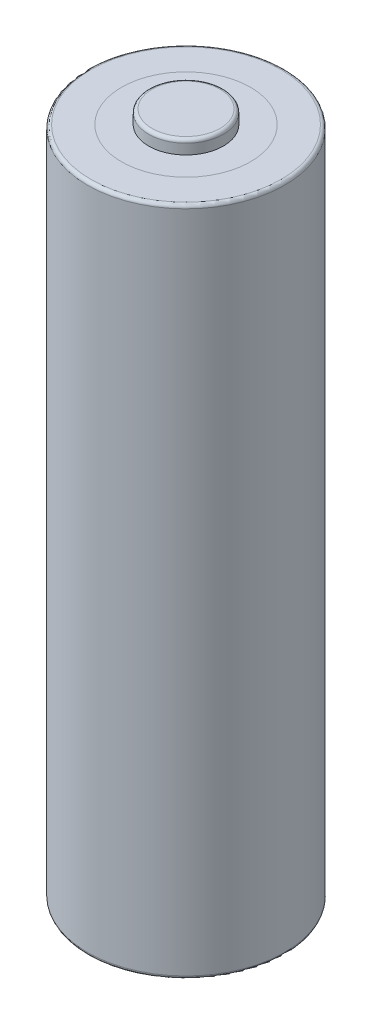
ISO-10303-21;
HEADER;
FILE_DESCRIPTION(('STEP AP214'),'2;1');
FILE_NAME('part.step','',(''),(''),'','','');
FILE_SCHEMA(('AUTOMOTIVE_DESIGN { 1 0 10303 214 1 1 1 1 }'));
ENDSEC;
DATA;
#1=APPLICATION_CONTEXT('core data for automotive mechanical design processes');
#2=APPLICATION_PROTOCOL_DEFINITION('international standard','automotive_design',2000,#1);
#3=PRODUCT_CONTEXT('',#1,'mechanical');
#4=PRODUCT('Part','Part','',(#3));
#5=PRODUCT_RELATED_PRODUCT_CATEGORY('part','',(#4));
#6=PRODUCT_DEFINITION_FORMATION('','',#4);
#7=PRODUCT_DEFINITION_CONTEXT('part definition',#1,'design');
#8=PRODUCT_DEFINITION('design','',#6,#7);
#9=PRODUCT_DEFINITION_SHAPE('','',#8);
#10=(LENGTH_UNIT() NAMED_UNIT(*) SI_UNIT(.MILLI.,.METRE.));
#11=(NAMED_UNIT(*) PLANE_ANGLE_UNIT() SI_UNIT($,.RADIAN.));
#12=(NAMED_UNIT(*) SI_UNIT($,.STERADIAN.) SOLID_ANGLE_UNIT());
#13=UNCERTAINTY_MEASURE_WITH_UNIT(LENGTH_MEASURE(1.E-05),#10,'distance_accuracy_value','');
#14=(GEOMETRIC_REPRESENTATION_CONTEXT(3) GLOBAL_UNCERTAINTY_ASSIGNED_CONTEXT((#13)) GLOBAL_UNIT_ASSIGNED_CONTEXT((#10,
#11,#12)) REPRESENTATION_CONTEXT('',''));
#15=CARTESIAN_POINT('',(0.,0.,0.));
#16=DIRECTION('',(0.,0.,1.));
#17=DIRECTION('',(1.,0.,0.));
#18=AXIS2_PLACEMENT_3D('',#15,#16,#17);
#19=CARTESIAN_POINT('',(0.,0.1,-7.));
#20=DIRECTION('',(0.,1.,0.));
#21=DIRECTION('',(0.,0.,1.));
#22=AXIS2_PLACEMENT_3D('',#19,#20,#21);
#23=PLANE('',#22);
#24=CARTESIAN_POINT('',(0.,0.1,0.));
#25=DIRECTION('',(0.,1.,0.));
#26=DIRECTION('',(0.,0.,1.));
#27=AXIS2_PLACEMENT_3D('',#24,#25,#26);
#28=CIRCLE('',#27,7.);
#29=CARTESIAN_POINT('',(0.,0.1,7.));
#30=VERTEX_POINT('',#29);
#31=EDGE_CURVE('E74',#30,#30,#28,.T.);
#32=ORIENTED_EDGE('',*,*,#31,.F.);
#33=EDGE_LOOP('',(#32));
#34=FACE_BOUND('',#33,.T.);
#35=CARTESIAN_POINT('',(0.,0.100000000000003,0.));
#36=DIRECTION('',(0.,1.,0.));
#37=DIRECTION('',(0.,0.,1.));
#38=AXIS2_PLACEMENT_3D('',#35,#36,#37);
#39=CIRCLE('',#38,4.74999999999999);
#40=CARTESIAN_POINT('',(0.,0.100000000000003,4.74999999999999));
#41=VERTEX_POINT('',#40);
#42=EDGE_CURVE('E10',#41,#41,#39,.F.);
#43=ORIENTED_EDGE('',*,*,#42,.F.);
#44=EDGE_LOOP('',(#43));
#45=FACE_BOUND('',#44,.T.);
#46=ADVANCED_FACE('F40',(#34,#45),#23,.F.);
#47=CARTESIAN_POINT('',(0.,49.5,-2.74999999999999));
#48=DIRECTION('',(0.,-1.,0.));
#49=DIRECTION('',(0.,0.,-1.));
#50=AXIS2_PLACEMENT_3D('',#47,#48,#49);
#51=PLANE('',#50);
#52=CARTESIAN_POINT('',(0.,49.5,0.));
#53=DIRECTION('',(0.,1.,0.));
#54=DIRECTION('',(0.,0.,1.));
#55=AXIS2_PLACEMENT_3D('',#52,#53,#54);
#56=CIRCLE('',#55,6.99999999999999);
#57=CARTESIAN_POINT('',(0.,49.5,6.99999999999999));
#58=VERTEX_POINT('',#57);
#59=EDGE_CURVE('E65',#58,#58,#56,.T.);
#60=ORIENTED_EDGE('',*,*,#59,.T.);
#61=EDGE_LOOP('',(#60));
#62=FACE_BOUND('',#61,.T.);
#63=CARTESIAN_POINT('',(0.,49.5,0.));
#64=DIRECTION('',(0.,-1.,0.));
#65=DIRECTION('',(0.,0.,-1.));
#66=AXIS2_PLACEMENT_3D('',#63,#64,#65);
#67=CIRCLE('',#66,4.74999999999999);
#68=CARTESIAN_POINT('',(0.,49.5,-4.74999999999999));
#69=VERTEX_POINT('',#68);
#70=EDGE_CURVE('E44',#69,#69,#67,.F.);
#71=ORIENTED_EDGE('',*,*,#70,.F.);
#72=EDGE_LOOP('',(#71));
#73=FACE_BOUND('',#72,.T.);
#74=ADVANCED_FACE('F88',(#62,#73),#51,.F.);
#75=CARTESIAN_POINT('',(0.,0.,-3.));
#76=DIRECTION('',(0.,1.,0.));
#77=DIRECTION('',(0.,0.,1.));
#78=AXIS2_PLACEMENT_3D('',#75,#76,#77);
#79=PLANE('',#78);
#80=CARTESIAN_POINT('',(0.,0.,0.));
#81=DIRECTION('',(0.,1.,0.));
#82=DIRECTION('',(0.,0.,1.));
#83=AXIS2_PLACEMENT_3D('',#80,#81,#82);
#84=CIRCLE('',#83,3.);
#85=CARTESIAN_POINT('',(0.,0.,3.));
#86=VERTEX_POINT('',#85);
#87=EDGE_CURVE('E80',#86,#86,#84,.T.);
#88=ORIENTED_EDGE('',*,*,#87,.F.);
#89=EDGE_LOOP('',(#88));
#90=FACE_BOUND('',#89,.T.);
#91=ADVANCED_FACE('F42',(#90),#79,.F.);
#92=CARTESIAN_POINT('',(0.,50.5,0.));
#93=DIRECTION('',(0.,-1.,0.));
#94=DIRECTION('',(0.,0.,-1.));
#95=AXIS2_PLACEMENT_3D('',#92,#93,#94);
#96=PLANE('',#95);
#97=CARTESIAN_POINT('',(0.,50.5,0.));
#98=DIRECTION('',(0.,1.,0.));
#99=DIRECTION('',(0.,0.,1.));
#100=AXIS2_PLACEMENT_3D('',#97,#98,#99);
#101=CIRCLE('',#100,2.49999999999999);
#102=CARTESIAN_POINT('',(0.,50.5,2.49999999999999));
#103=VERTEX_POINT('',#102);
#104=EDGE_CURVE('E55',#103,#103,#101,.T.);
#105=ORIENTED_EDGE('',*,*,#104,.T.);
#106=EDGE_LOOP('',(#105));
#107=FACE_BOUND('',#106,.T.);
#108=ADVANCED_FACE('F87',(#107),#96,.F.);
#109=CARTESIAN_POINT('',(0.,50.25,0.));
#110=DIRECTION('',(0.,1.,0.));
#111=DIRECTION('',(0.,0.,1.));
#112=AXIS2_PLACEMENT_3D('',#109,#110,#111);
#113=TOROIDAL_SURFACE('',#112,2.49999999999999,0.25);
#114=ORIENTED_EDGE('',*,*,#104,.F.);
#115=EDGE_LOOP('',(#114));
#116=FACE_BOUND('',#115,.T.);
#117=CARTESIAN_POINT('',(0.,50.25,0.));
#118=DIRECTION('',(0.,1.,0.));
#119=DIRECTION('',(0.,0.,1.));
#120=AXIS2_PLACEMENT_3D('',#117,#118,#119);
#121=CIRCLE('',#120,2.74999999999999);
#122=CARTESIAN_POINT('',(0.,50.25,2.74999999999999));
#123=VERTEX_POINT('',#122);
#124=EDGE_CURVE('E59',#123,#123,#121,.T.);
#125=ORIENTED_EDGE('',*,*,#124,.T.);
#126=EDGE_LOOP('',(#125));
#127=FACE_BOUND('',#126,.T.);
#128=ADVANCED_FACE('F93',(#116,#127),#113,.T.);
#129=CARTESIAN_POINT('',(0.,0.,0.));
#130=DIRECTION('',(0.,1.,0.));
#131=DIRECTION('',(0.,0.,1.));
#132=AXIS2_PLACEMENT_3D('',#129,#130,#131);
#133=CYLINDRICAL_SURFACE('',#132,2.74999999999999);
#134=ORIENTED_EDGE('',*,*,#124,.F.);
#135=EDGE_LOOP('',(#134));
#136=FACE_BOUND('',#135,.T.);
#137=CARTESIAN_POINT('',(0.,49.5,0.));
#138=DIRECTION('',(0.,1.,0.));
#139=DIRECTION('',(0.,0.,1.));
#140=AXIS2_PLACEMENT_3D('',#137,#138,#139);
#141=CIRCLE('',#140,2.74999999999999);
#142=CARTESIAN_POINT('',(0.,49.5,2.74999999999999));
#143=VERTEX_POINT('',#142);
#144=EDGE_CURVE('E62',#143,#143,#141,.T.);
#145=ORIENTED_EDGE('',*,*,#144,.T.);
#146=EDGE_LOOP('',(#145));
#147=FACE_BOUND('',#146,.T.);
#148=ADVANCED_FACE('F132',(#136,#147),#133,.T.);
#149=ORIENTED_EDGE('',*,*,#70,.T.);
#150=EDGE_LOOP('',(#149));
#151=FACE_BOUND('',#150,.T.);
#152=ORIENTED_EDGE('',*,*,#144,.F.);
#153=EDGE_LOOP('',(#152));
#154=FACE_BOUND('',#153,.T.);
#155=ADVANCED_FACE('F97',(#151,#154),#51,.F.);
#156=CARTESIAN_POINT('',(0.,49.25,0.));
#157=DIRECTION('',(0.,1.,0.));
#158=DIRECTION('',(0.,0.,1.));
#159=AXIS2_PLACEMENT_3D('',#156,#157,#158);
#160=TOROIDAL_SURFACE('',#159,6.99999999999999,0.25);
#161=ORIENTED_EDGE('',*,*,#59,.F.);
#162=EDGE_LOOP('',(#161));
#163=FACE_BOUND('',#162,.T.);
#164=CARTESIAN_POINT('',(0.,49.25,0.));
#165=DIRECTION('',(0.,1.,0.));
#166=DIRECTION('',(0.,0.,1.));
#167=AXIS2_PLACEMENT_3D('',#164,#165,#166);
#168=CIRCLE('',#167,7.25);
#169=CARTESIAN_POINT('',(0.,49.25,7.25));
#170=VERTEX_POINT('',#169);
#171=EDGE_CURVE('E68',#170,#170,#168,.T.);
#172=ORIENTED_EDGE('',*,*,#171,.T.);
#173=EDGE_LOOP('',(#172));
#174=FACE_BOUND('',#173,.T.);
#175=ADVANCED_FACE('F122',(#163,#174),#160,.T.);
#176=CARTESIAN_POINT('',(0.,0.,0.));
#177=DIRECTION('',(0.,1.,0.));
#178=DIRECTION('',(0.,0.,1.));
#179=AXIS2_PLACEMENT_3D('',#176,#177,#178);
#180=CYLINDRICAL_SURFACE('',#179,7.25);
#181=ORIENTED_EDGE('',*,*,#171,.F.);
#182=EDGE_LOOP('',(#181));
#183=FACE_BOUND('',#182,.T.);
#184=CARTESIAN_POINT('',(0.,0.350000000000002,0.));
#185=DIRECTION('',(0.,1.,0.));
#186=DIRECTION('',(0.,0.,1.));
#187=AXIS2_PLACEMENT_3D('',#184,#185,#186);
#188=CIRCLE('',#187,7.25);
#189=CARTESIAN_POINT('',(0.,0.350000000000002,7.25));
#190=VERTEX_POINT('',#189);
#191=EDGE_CURVE('E71',#190,#190,#188,.T.);
#192=ORIENTED_EDGE('',*,*,#191,.T.);
#193=EDGE_LOOP('',(#192));
#194=FACE_BOUND('',#193,.T.);
#195=ADVANCED_FACE('F115',(#183,#194),#180,.T.);
#196=CARTESIAN_POINT('',(0.,0.35,0.));
#197=DIRECTION('',(0.,1.,0.));
#198=DIRECTION('',(0.,0.,1.));
#199=AXIS2_PLACEMENT_3D('',#196,#197,#198);
#200=TOROIDAL_SURFACE('',#199,7.,0.25);
#201=ORIENTED_EDGE('',*,*,#191,.F.);
#202=EDGE_LOOP('',(#201));
#203=FACE_BOUND('',#202,.T.);
#204=ORIENTED_EDGE('',*,*,#31,.T.);
#205=EDGE_LOOP('',(#204));
#206=FACE_BOUND('',#205,.T.);
#207=ADVANCED_FACE('F109',(#203,#206),#200,.T.);
#208=ORIENTED_EDGE('',*,*,#42,.T.);
#209=EDGE_LOOP('',(#208));
#210=FACE_BOUND('',#209,.T.);
#211=CARTESIAN_POINT('',(0.,0.1,0.));
#212=DIRECTION('',(0.,1.,0.));
#213=DIRECTION('',(0.,0.,1.));
#214=AXIS2_PLACEMENT_3D('',#211,#212,#213);
#215=CIRCLE('',#214,3.5);
#216=CARTESIAN_POINT('',(0.,0.1,3.5));
#217=VERTEX_POINT('',#216);
#218=EDGE_CURVE('E77',#217,#217,#215,.T.);
#219=ORIENTED_EDGE('',*,*,#218,.T.);
#220=EDGE_LOOP('',(#219));
#221=FACE_BOUND('',#220,.T.);
#222=ADVANCED_FACE('F101',(#210,#221),#23,.F.);
#223=CARTESIAN_POINT('',(0.,0.,0.));
#224=DIRECTION('',(0.,1.,0.));
#225=DIRECTION('',(0.,0.,1.));
#226=AXIS2_PLACEMENT_3D('',#223,#224,#225);
#227=CONICAL_SURFACE('',#226,3.,1.37340076694502);
#228=ORIENTED_EDGE('',*,*,#218,.F.);
#229=EDGE_LOOP('',(#228));
#230=FACE_BOUND('',#229,.T.);
#231=ORIENTED_EDGE('',*,*,#87,.T.);
#232=EDGE_LOOP('',(#231));
#233=FACE_BOUND('',#232,.T.);
#234=ADVANCED_FACE('F84',(#230,#233),#227,.T.);
#235=CLOSED_SHELL('',(#46,#74,#91,#108,#128,#148,#155,#175,#195,#207,#222,#234));
#236=MANIFOLD_SOLID_BREP('B2',#235);
#237=ADVANCED_BREP_SHAPE_REPRESENTATION('',(#18,#236),#14);
#238=SHAPE_DEFINITION_REPRESENTATION(#9,#237);
ENDSEC;
END-ISO-10303-21;
